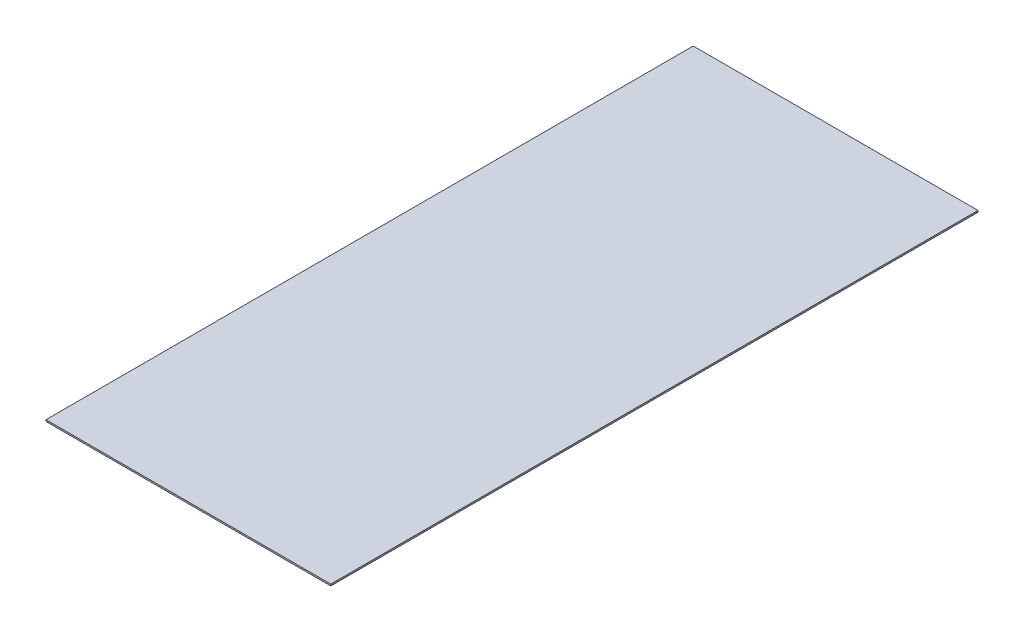
ISO-10303-21;
HEADER;
FILE_DESCRIPTION(('STEP AP214'),'2;1');
FILE_NAME('part.step','',(''),(''),'','','');
FILE_SCHEMA(('AUTOMOTIVE_DESIGN { 1 0 10303 214 1 1 1 1 }'));
ENDSEC;
DATA;
#1=APPLICATION_CONTEXT('core data for automotive mechanical design processes');
#2=APPLICATION_PROTOCOL_DEFINITION('international standard','automotive_design',2000,#1);
#3=PRODUCT_CONTEXT('',#1,'mechanical');
#4=PRODUCT('Part','Part','',(#3));
#5=PRODUCT_RELATED_PRODUCT_CATEGORY('part','',(#4));
#6=PRODUCT_DEFINITION_FORMATION('','',#4);
#7=PRODUCT_DEFINITION_CONTEXT('part definition',#1,'design');
#8=PRODUCT_DEFINITION('design','',#6,#7);
#9=PRODUCT_DEFINITION_SHAPE('','',#8);
#10=(LENGTH_UNIT() NAMED_UNIT(*) SI_UNIT(.MILLI.,.METRE.));
#11=(NAMED_UNIT(*) PLANE_ANGLE_UNIT() SI_UNIT($,.RADIAN.));
#12=(NAMED_UNIT(*) SI_UNIT($,.STERADIAN.) SOLID_ANGLE_UNIT());
#13=UNCERTAINTY_MEASURE_WITH_UNIT(LENGTH_MEASURE(1.E-05),#10,'distance_accuracy_value','');
#14=(GEOMETRIC_REPRESENTATION_CONTEXT(3) GLOBAL_UNCERTAINTY_ASSIGNED_CONTEXT((#13)) GLOBAL_UNIT_ASSIGNED_CONTEXT((#10,
#11,#12)) REPRESENTATION_CONTEXT('',''));
#15=CARTESIAN_POINT('',(0.,0.,0.));
#16=DIRECTION('',(0.,0.,1.));
#17=DIRECTION('',(1.,0.,0.));
#18=AXIS2_PLACEMENT_3D('',#15,#16,#17);
#19=CARTESIAN_POINT('',(139.7,-0.79375,635.));
#20=DIRECTION('',(-1.,0.,0.));
#21=DIRECTION('',(0.,0.,1.));
#22=AXIS2_PLACEMENT_3D('',#19,#20,#21);
#23=PLANE('',#22);
#24=DIRECTION('',(0.,1.,0.));
#25=VECTOR('',#24,1.);
#26=CARTESIAN_POINT('',(139.7,-0.79375,0.));
#27=LINE('',#26,#25);
#28=CARTESIAN_POINT('',(139.7,-0.79375,0.));
#29=VERTEX_POINT('',#28);
#30=CARTESIAN_POINT('',(139.7,0.79375,0.));
#31=VERTEX_POINT('',#30);
#32=EDGE_CURVE('E96',#29,#31,#27,.T.);
#33=ORIENTED_EDGE('',*,*,#32,.T.);
#34=DIRECTION('',(0.,0.,-1.));
#35=VECTOR('',#34,1.);
#36=CARTESIAN_POINT('',(139.7,0.79375,635.));
#37=LINE('',#36,#35);
#38=CARTESIAN_POINT('',(139.7,0.79375,635.));
#39=VERTEX_POINT('',#38);
#40=EDGE_CURVE('E11',#39,#31,#37,.T.);
#41=ORIENTED_EDGE('',*,*,#40,.F.);
#42=DIRECTION('',(0.,1.,0.));
#43=VECTOR('',#42,1.);
#44=CARTESIAN_POINT('',(139.7,-0.79375,635.));
#45=LINE('',#44,#43);
#46=CARTESIAN_POINT('',(139.7,-0.79375,635.));
#47=VERTEX_POINT('',#46);
#48=EDGE_CURVE('E84',#47,#39,#45,.T.);
#49=ORIENTED_EDGE('',*,*,#48,.F.);
#50=DIRECTION('',(0.,0.,-1.));
#51=VECTOR('',#50,1.);
#52=CARTESIAN_POINT('',(139.7,-0.79375,635.));
#53=LINE('',#52,#51);
#54=EDGE_CURVE('E92',#47,#29,#53,.T.);
#55=ORIENTED_EDGE('',*,*,#54,.T.);
#56=EDGE_LOOP('',(#33,#41,#49,#55));
#57=FACE_BOUND('',#56,.T.);
#58=ADVANCED_FACE('F33',(#57),#23,.F.);
#59=CARTESIAN_POINT('',(-139.7,0.79375,635.));
#60=DIRECTION('',(0.,-1.,0.));
#61=DIRECTION('',(0.,0.,-1.));
#62=AXIS2_PLACEMENT_3D('',#59,#60,#61);
#63=PLANE('',#62);
#64=DIRECTION('',(-1.,0.,0.));
#65=VECTOR('',#64,1.);
#66=CARTESIAN_POINT('',(-139.7,0.79375,0.));
#67=LINE('',#66,#65);
#68=CARTESIAN_POINT('',(-139.7,0.79375,0.));
#69=VERTEX_POINT('',#68);
#70=EDGE_CURVE('E88',#31,#69,#67,.T.);
#71=ORIENTED_EDGE('',*,*,#70,.T.);
#72=DIRECTION('',(0.,0.,-1.));
#73=VECTOR('',#72,1.);
#74=CARTESIAN_POINT('',(-139.7,0.79375,635.));
#75=LINE('',#74,#73);
#76=CARTESIAN_POINT('',(-139.7,0.79375,635.));
#77=VERTEX_POINT('',#76);
#78=EDGE_CURVE('E41',#77,#69,#75,.T.);
#79=ORIENTED_EDGE('',*,*,#78,.F.);
#80=DIRECTION('',(-1.,0.,0.));
#81=VECTOR('',#80,1.);
#82=CARTESIAN_POINT('',(-139.7,0.79375,635.));
#83=LINE('',#82,#81);
#84=EDGE_CURVE('E79',#39,#77,#83,.T.);
#85=ORIENTED_EDGE('',*,*,#84,.F.);
#86=ORIENTED_EDGE('',*,*,#40,.T.);
#87=EDGE_LOOP('',(#71,#79,#85,#86));
#88=FACE_BOUND('',#87,.T.);
#89=ADVANCED_FACE('F87',(#88),#63,.F.);
#90=CARTESIAN_POINT('',(-139.7,-0.79375,635.));
#91=DIRECTION('',(1.,0.,0.));
#92=DIRECTION('',(0.,0.,-1.));
#93=AXIS2_PLACEMENT_3D('',#90,#91,#92);
#94=PLANE('',#93);
#95=DIRECTION('',(0.,-1.,0.));
#96=VECTOR('',#95,1.);
#97=CARTESIAN_POINT('',(-139.7,-0.79375,0.));
#98=LINE('',#97,#96);
#99=CARTESIAN_POINT('',(-139.7,-0.79375,0.));
#100=VERTEX_POINT('',#99);
#101=EDGE_CURVE('E66',#69,#100,#98,.T.);
#102=ORIENTED_EDGE('',*,*,#101,.T.);
#103=DIRECTION('',(0.,0.,-1.));
#104=VECTOR('',#103,1.);
#105=CARTESIAN_POINT('',(-139.7,-0.79375,635.));
#106=LINE('',#105,#104);
#107=CARTESIAN_POINT('',(-139.7,-0.79375,635.));
#108=VERTEX_POINT('',#107);
#109=EDGE_CURVE('E89',#108,#100,#106,.T.);
#110=ORIENTED_EDGE('',*,*,#109,.F.);
#111=DIRECTION('',(0.,-1.,0.));
#112=VECTOR('',#111,1.);
#113=CARTESIAN_POINT('',(-139.7,-0.79375,635.));
#114=LINE('',#113,#112);
#115=EDGE_CURVE('E82',#77,#108,#114,.T.);
#116=ORIENTED_EDGE('',*,*,#115,.F.);
#117=ORIENTED_EDGE('',*,*,#78,.T.);
#118=EDGE_LOOP('',(#102,#110,#116,#117));
#119=FACE_BOUND('',#118,.T.);
#120=ADVANCED_FACE('F90',(#119),#94,.F.);
#121=CARTESIAN_POINT('',(-139.7,-0.79375,635.));
#122=DIRECTION('',(0.,1.,0.));
#123=DIRECTION('',(0.,0.,1.));
#124=AXIS2_PLACEMENT_3D('',#121,#122,#123);
#125=PLANE('',#124);
#126=DIRECTION('',(1.,0.,0.));
#127=VECTOR('',#126,1.);
#128=CARTESIAN_POINT('',(-139.7,-0.79375,0.));
#129=LINE('',#128,#127);
#130=EDGE_CURVE('E72',#100,#29,#129,.T.);
#131=ORIENTED_EDGE('',*,*,#130,.T.);
#132=ORIENTED_EDGE('',*,*,#54,.F.);
#133=DIRECTION('',(1.,0.,0.));
#134=VECTOR('',#133,1.);
#135=CARTESIAN_POINT('',(-139.7,-0.79375,635.));
#136=LINE('',#135,#134);
#137=EDGE_CURVE('E49',#108,#47,#136,.T.);
#138=ORIENTED_EDGE('',*,*,#137,.F.);
#139=ORIENTED_EDGE('',*,*,#109,.T.);
#140=EDGE_LOOP('',(#131,#132,#138,#139));
#141=FACE_BOUND('',#140,.T.);
#142=ADVANCED_FACE('F103',(#141),#125,.F.);
#143=CARTESIAN_POINT('',(0.,0.,635.));
#144=DIRECTION('',(0.,0.,-1.));
#145=DIRECTION('',(-1.,0.,0.));
#146=AXIS2_PLACEMENT_3D('',#143,#144,#145);
#147=PLANE('',#146);
#148=ORIENTED_EDGE('',*,*,#48,.T.);
#149=ORIENTED_EDGE('',*,*,#84,.T.);
#150=ORIENTED_EDGE('',*,*,#115,.T.);
#151=ORIENTED_EDGE('',*,*,#137,.T.);
#152=EDGE_LOOP('',(#148,#149,#150,#151));
#153=FACE_BOUND('',#152,.T.);
#154=ADVANCED_FACE('F80',(#153),#147,.F.);
#155=CARTESIAN_POINT('',(0.,0.,0.));
#156=DIRECTION('',(0.,0.,-1.));
#157=DIRECTION('',(-1.,0.,0.));
#158=AXIS2_PLACEMENT_3D('',#155,#156,#157);
#159=PLANE('',#158);
#160=ORIENTED_EDGE('',*,*,#32,.F.);
#161=ORIENTED_EDGE('',*,*,#130,.F.);
#162=ORIENTED_EDGE('',*,*,#101,.F.);
#163=ORIENTED_EDGE('',*,*,#70,.F.);
#164=EDGE_LOOP('',(#160,#161,#162,#163));
#165=FACE_BOUND('',#164,.T.);
#166=ADVANCED_FACE('F106',(#165),#159,.T.);
#167=CLOSED_SHELL('',(#58,#89,#120,#142,#154,#166));
#168=MANIFOLD_SOLID_BREP('B2',#167);
#169=ADVANCED_BREP_SHAPE_REPRESENTATION('',(#18,#168),#14);
#170=SHAPE_DEFINITION_REPRESENTATION(#9,#169);
ENDSEC;
END-ISO-10303-21;
